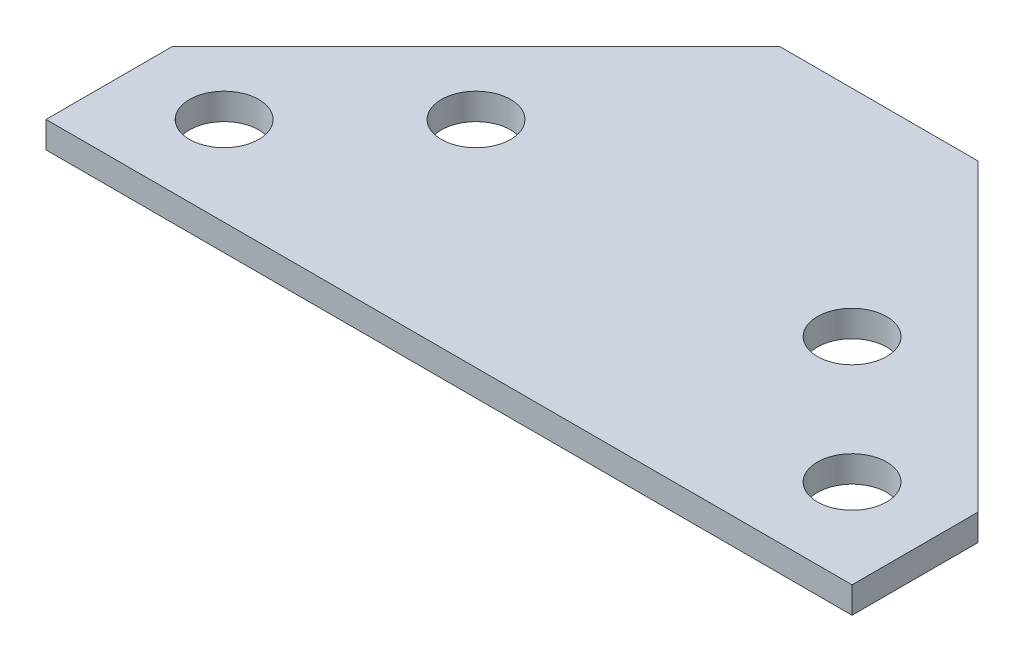
ISO-10303-21;
HEADER;
FILE_DESCRIPTION(('STEP AP214'),'2;1');
FILE_NAME('part.step','',(''),(''),'','','');
FILE_SCHEMA(('AUTOMOTIVE_DESIGN { 1 0 10303 214 1 1 1 1 }'));
ENDSEC;
DATA;
#1=APPLICATION_CONTEXT('core data for automotive mechanical design processes');
#2=APPLICATION_PROTOCOL_DEFINITION('international standard','automotive_design',2000,#1);
#3=PRODUCT_CONTEXT('',#1,'mechanical');
#4=PRODUCT('Part','Part','',(#3));
#5=PRODUCT_RELATED_PRODUCT_CATEGORY('part','',(#4));
#6=PRODUCT_DEFINITION_FORMATION('','',#4);
#7=PRODUCT_DEFINITION_CONTEXT('part definition',#1,'design');
#8=PRODUCT_DEFINITION('design','',#6,#7);
#9=PRODUCT_DEFINITION_SHAPE('','',#8);
#10=(LENGTH_UNIT() NAMED_UNIT(*) SI_UNIT(.MILLI.,.METRE.));
#11=(NAMED_UNIT(*) PLANE_ANGLE_UNIT() SI_UNIT($,.RADIAN.));
#12=(NAMED_UNIT(*) SI_UNIT($,.STERADIAN.) SOLID_ANGLE_UNIT());
#13=UNCERTAINTY_MEASURE_WITH_UNIT(LENGTH_MEASURE(1.E-05),#10,'distance_accuracy_value','');
#14=(GEOMETRIC_REPRESENTATION_CONTEXT(3) GLOBAL_UNCERTAINTY_ASSIGNED_CONTEXT((#13)) GLOBAL_UNIT_ASSIGNED_CONTEXT((#10,
#11,#12)) REPRESENTATION_CONTEXT('',''));
#15=CARTESIAN_POINT('',(0.,0.,0.));
#16=DIRECTION('',(0.,0.,1.));
#17=DIRECTION('',(1.,0.,0.));
#18=AXIS2_PLACEMENT_3D('',#15,#16,#17);
#19=CARTESIAN_POINT('',(-61.0918830920367,-4.,-19.0918830920368));
#20=DIRECTION('',(-1.,0.,0.));
#21=DIRECTION('',(0.,0.,1.));
#22=AXIS2_PLACEMENT_3D('',#19,#20,#21);
#23=PLANE('',#22);
#24=DIRECTION('',(0.,0.,1.));
#25=VECTOR('',#24,1.);
#26=CARTESIAN_POINT('',(-61.0918830920367,0.,-19.0918830920368));
#27=LINE('',#26,#25);
#28=CARTESIAN_POINT('',(-61.0918830920367,0.,-19.0918830920368));
#29=VERTEX_POINT('',#28);
#30=CARTESIAN_POINT('',(-61.0918830920367,0.,0.));
#31=VERTEX_POINT('',#30);
#32=EDGE_CURVE('E125',#29,#31,#27,.T.);
#33=ORIENTED_EDGE('',*,*,#32,.F.);
#34=DIRECTION('',(0.,1.,0.));
#35=VECTOR('',#34,1.);
#36=CARTESIAN_POINT('',(-61.0918830920367,-4.,-19.0918830920368));
#37=LINE('',#36,#35);
#38=CARTESIAN_POINT('',(-61.0918830920367,-4.,-19.0918830920368));
#39=VERTEX_POINT('',#38);
#40=EDGE_CURVE('E11',#39,#29,#37,.T.);
#41=ORIENTED_EDGE('',*,*,#40,.F.);
#42=DIRECTION('',(0.,0.,1.));
#43=VECTOR('',#42,1.);
#44=CARTESIAN_POINT('',(-61.0918830920367,-4.,-19.0918830920368));
#45=LINE('',#44,#43);
#46=CARTESIAN_POINT('',(-61.0918830920367,-4.,0.));
#47=VERTEX_POINT('',#46);
#48=EDGE_CURVE('E140',#39,#47,#45,.T.);
#49=ORIENTED_EDGE('',*,*,#48,.T.);
#50=DIRECTION('',(0.,1.,0.));
#51=VECTOR('',#50,1.);
#52=CARTESIAN_POINT('',(-61.0918830920367,-4.,0.));
#53=LINE('',#52,#51);
#54=EDGE_CURVE('E43',#47,#31,#53,.T.);
#55=ORIENTED_EDGE('',*,*,#54,.T.);
#56=EDGE_LOOP('',(#33,#41,#49,#55));
#57=FACE_BOUND('',#56,.T.);
#58=ADVANCED_FACE('F39',(#57),#23,.T.);
#59=CARTESIAN_POINT('',(-15.,-4.,-65.1837661840737));
#60=DIRECTION('',(-0.707106781186549,0.,-0.707106781186546));
#61=DIRECTION('',(-0.707106781186546,0.,0.707106781186549));
#62=AXIS2_PLACEMENT_3D('',#59,#60,#61);
#63=PLANE('',#62);
#64=DIRECTION('',(-0.707106781186546,0.,0.707106781186549));
#65=VECTOR('',#64,1.);
#66=CARTESIAN_POINT('',(-15.,0.,-65.1837661840737));
#67=LINE('',#66,#65);
#68=CARTESIAN_POINT('',(-15.,0.,-65.1837661840737));
#69=VERTEX_POINT('',#68);
#70=EDGE_CURVE('E138',#69,#29,#67,.T.);
#71=ORIENTED_EDGE('',*,*,#70,.F.);
#72=DIRECTION('',(0.,1.,0.));
#73=VECTOR('',#72,1.);
#74=CARTESIAN_POINT('',(-15.,-4.,-65.1837661840737));
#75=LINE('',#74,#73);
#76=CARTESIAN_POINT('',(-15.,-4.,-65.1837661840737));
#77=VERTEX_POINT('',#76);
#78=EDGE_CURVE('E49',#77,#69,#75,.T.);
#79=ORIENTED_EDGE('',*,*,#78,.F.);
#80=DIRECTION('',(-0.707106781186546,0.,0.707106781186549));
#81=VECTOR('',#80,1.);
#82=CARTESIAN_POINT('',(-15.,-4.,-65.1837661840737));
#83=LINE('',#82,#81);
#84=EDGE_CURVE('E115',#77,#39,#83,.T.);
#85=ORIENTED_EDGE('',*,*,#84,.T.);
#86=ORIENTED_EDGE('',*,*,#40,.T.);
#87=EDGE_LOOP('',(#71,#79,#85,#86));
#88=FACE_BOUND('',#87,.T.);
#89=ADVANCED_FACE('F147',(#88),#63,.T.);
#90=CARTESIAN_POINT('',(15.,-4.,-65.1837661840737));
#91=DIRECTION('',(0.,0.,-1.));
#92=DIRECTION('',(-1.,0.,0.));
#93=AXIS2_PLACEMENT_3D('',#90,#91,#92);
#94=PLANE('',#93);
#95=DIRECTION('',(-1.,0.,0.));
#96=VECTOR('',#95,1.);
#97=CARTESIAN_POINT('',(15.,0.,-65.1837661840737));
#98=LINE('',#97,#96);
#99=CARTESIAN_POINT('',(15.,0.,-65.1837661840737));
#100=VERTEX_POINT('',#99);
#101=EDGE_CURVE('E102',#100,#69,#98,.T.);
#102=ORIENTED_EDGE('',*,*,#101,.F.);
#103=DIRECTION('',(0.,1.,0.));
#104=VECTOR('',#103,1.);
#105=CARTESIAN_POINT('',(15.,-4.,-65.1837661840737));
#106=LINE('',#105,#104);
#107=CARTESIAN_POINT('',(15.,-4.,-65.1837661840737));
#108=VERTEX_POINT('',#107);
#109=EDGE_CURVE('E97',#108,#100,#106,.T.);
#110=ORIENTED_EDGE('',*,*,#109,.F.);
#111=DIRECTION('',(-1.,0.,0.));
#112=VECTOR('',#111,1.);
#113=CARTESIAN_POINT('',(15.,-4.,-65.1837661840737));
#114=LINE('',#113,#112);
#115=EDGE_CURVE('E100',#108,#77,#114,.T.);
#116=ORIENTED_EDGE('',*,*,#115,.T.);
#117=ORIENTED_EDGE('',*,*,#78,.T.);
#118=EDGE_LOOP('',(#102,#110,#116,#117));
#119=FACE_BOUND('',#118,.T.);
#120=ADVANCED_FACE('F99',(#119),#94,.T.);
#121=CARTESIAN_POINT('',(61.0918830920367,-4.,-19.0918830920368));
#122=DIRECTION('',(0.707106781186549,0.,-0.707106781186546));
#123=DIRECTION('',(-0.707106781186546,0.,-0.707106781186549));
#124=AXIS2_PLACEMENT_3D('',#121,#122,#123);
#125=PLANE('',#124);
#126=DIRECTION('',(-0.707106781186546,0.,-0.707106781186549));
#127=VECTOR('',#126,1.);
#128=CARTESIAN_POINT('',(61.0918830920367,0.,-19.0918830920368));
#129=LINE('',#128,#127);
#130=CARTESIAN_POINT('',(61.0918830920367,0.,-19.0918830920368));
#131=VERTEX_POINT('',#130);
#132=EDGE_CURVE('E135',#131,#100,#129,.T.);
#133=ORIENTED_EDGE('',*,*,#132,.F.);
#134=DIRECTION('',(0.,1.,0.));
#135=VECTOR('',#134,1.);
#136=CARTESIAN_POINT('',(61.0918830920367,-4.,-19.0918830920368));
#137=LINE('',#136,#135);
#138=CARTESIAN_POINT('',(61.0918830920367,-4.,-19.0918830920368));
#139=VERTEX_POINT('',#138);
#140=EDGE_CURVE('E107',#139,#131,#137,.T.);
#141=ORIENTED_EDGE('',*,*,#140,.F.);
#142=DIRECTION('',(-0.707106781186546,0.,-0.707106781186549));
#143=VECTOR('',#142,1.);
#144=CARTESIAN_POINT('',(61.0918830920367,-4.,-19.0918830920368));
#145=LINE('',#144,#143);
#146=EDGE_CURVE('E113',#139,#108,#145,.T.);
#147=ORIENTED_EDGE('',*,*,#146,.T.);
#148=ORIENTED_EDGE('',*,*,#109,.T.);
#149=EDGE_LOOP('',(#133,#141,#147,#148));
#150=FACE_BOUND('',#149,.T.);
#151=ADVANCED_FACE('F117',(#150),#125,.T.);
#152=CARTESIAN_POINT('',(61.0918830920367,-4.,0.));
#153=DIRECTION('',(1.,0.,0.));
#154=DIRECTION('',(0.,0.,-1.));
#155=AXIS2_PLACEMENT_3D('',#152,#153,#154);
#156=PLANE('',#155);
#157=DIRECTION('',(0.,0.,-1.));
#158=VECTOR('',#157,1.);
#159=CARTESIAN_POINT('',(61.0918830920367,0.,0.));
#160=LINE('',#159,#158);
#161=CARTESIAN_POINT('',(61.0918830920367,0.,0.));
#162=VERTEX_POINT('',#161);
#163=EDGE_CURVE('E132',#162,#131,#160,.T.);
#164=ORIENTED_EDGE('',*,*,#163,.F.);
#165=DIRECTION('',(0.,1.,0.));
#166=VECTOR('',#165,1.);
#167=CARTESIAN_POINT('',(61.0918830920367,-4.,0.));
#168=LINE('',#167,#166);
#169=CARTESIAN_POINT('',(61.0918830920367,-4.,0.));
#170=VERTEX_POINT('',#169);
#171=EDGE_CURVE('E143',#170,#162,#168,.T.);
#172=ORIENTED_EDGE('',*,*,#171,.F.);
#173=DIRECTION('',(0.,0.,-1.));
#174=VECTOR('',#173,1.);
#175=CARTESIAN_POINT('',(61.0918830920367,-4.,0.));
#176=LINE('',#175,#174);
#177=EDGE_CURVE('E118',#170,#139,#176,.T.);
#178=ORIENTED_EDGE('',*,*,#177,.T.);
#179=ORIENTED_EDGE('',*,*,#140,.T.);
#180=EDGE_LOOP('',(#164,#172,#178,#179));
#181=FACE_BOUND('',#180,.T.);
#182=ADVANCED_FACE('F160',(#181),#156,.T.);
#183=CARTESIAN_POINT('',(-61.0918830920367,-4.,0.));
#184=DIRECTION('',(0.,0.,1.));
#185=DIRECTION('',(1.,0.,0.));
#186=AXIS2_PLACEMENT_3D('',#183,#184,#185);
#187=PLANE('',#186);
#188=DIRECTION('',(1.,0.,0.));
#189=VECTOR('',#188,1.);
#190=CARTESIAN_POINT('',(-61.0918830920367,0.,0.));
#191=LINE('',#190,#189);
#192=EDGE_CURVE('E128',#31,#162,#191,.T.);
#193=ORIENTED_EDGE('',*,*,#192,.F.);
#194=ORIENTED_EDGE('',*,*,#54,.F.);
#195=DIRECTION('',(1.,0.,0.));
#196=VECTOR('',#195,1.);
#197=CARTESIAN_POINT('',(-61.0918830920367,-4.,0.));
#198=LINE('',#197,#196);
#199=EDGE_CURVE('E120',#47,#170,#198,.T.);
#200=ORIENTED_EDGE('',*,*,#199,.T.);
#201=ORIENTED_EDGE('',*,*,#171,.T.);
#202=EDGE_LOOP('',(#193,#194,#200,#201));
#203=FACE_BOUND('',#202,.T.);
#204=ADVANCED_FACE('F145',(#203),#187,.T.);
#205=CARTESIAN_POINT('',(0.,-4.,0.));
#206=DIRECTION('',(0.,1.,0.));
#207=DIRECTION('',(0.,0.,1.));
#208=AXIS2_PLACEMENT_3D('',#205,#206,#207);
#209=PLANE('',#208);
#210=CARTESIAN_POINT('',(28.5,-4.,-32.5918830920368));
#211=DIRECTION('',(0.,1.,0.));
#212=DIRECTION('',(0.,0.,-1.));
#213=AXIS2_PLACEMENT_3D('',#210,#211,#212);
#214=CIRCLE('',#213,5.25);
#215=CARTESIAN_POINT('',(28.5,-4.,-37.8418830920368));
#216=VERTEX_POINT('',#215);
#217=EDGE_CURVE('E177',#216,#216,#214,.T.);
#218=ORIENTED_EDGE('',*,*,#217,.T.);
#219=EDGE_LOOP('',(#218));
#220=FACE_BOUND('',#219,.T.);
#221=CARTESIAN_POINT('',(47.5918830920367,-4.,-13.5));
#222=DIRECTION('',(0.,1.,0.));
#223=DIRECTION('',(0.,0.,-1.));
#224=AXIS2_PLACEMENT_3D('',#221,#222,#223);
#225=CIRCLE('',#224,5.25);
#226=CARTESIAN_POINT('',(47.5918830920367,-4.,-18.75));
#227=VERTEX_POINT('',#226);
#228=EDGE_CURVE('E181',#227,#227,#225,.T.);
#229=ORIENTED_EDGE('',*,*,#228,.T.);
#230=EDGE_LOOP('',(#229));
#231=FACE_BOUND('',#230,.T.);
#232=CARTESIAN_POINT('',(-47.5918830920367,-4.,-13.5));
#233=DIRECTION('',(0.,1.,0.));
#234=DIRECTION('',(0.,0.,1.));
#235=AXIS2_PLACEMENT_3D('',#232,#233,#234);
#236=CIRCLE('',#235,5.25);
#237=CARTESIAN_POINT('',(-47.5918830920367,-4.,-8.25));
#238=VERTEX_POINT('',#237);
#239=EDGE_CURVE('E185',#238,#238,#236,.T.);
#240=ORIENTED_EDGE('',*,*,#239,.T.);
#241=EDGE_LOOP('',(#240));
#242=FACE_BOUND('',#241,.T.);
#243=CARTESIAN_POINT('',(-28.5,-4.,-32.5918830920368));
#244=DIRECTION('',(0.,1.,0.));
#245=DIRECTION('',(0.,0.,1.));
#246=AXIS2_PLACEMENT_3D('',#243,#244,#245);
#247=CIRCLE('',#246,5.25);
#248=CARTESIAN_POINT('',(-28.5,-4.,-27.3418830920368));
#249=VERTEX_POINT('',#248);
#250=EDGE_CURVE('E129',#249,#249,#247,.T.);
#251=ORIENTED_EDGE('',*,*,#250,.T.);
#252=EDGE_LOOP('',(#251));
#253=FACE_BOUND('',#252,.T.);
#254=ORIENTED_EDGE('',*,*,#48,.F.);
#255=ORIENTED_EDGE('',*,*,#84,.F.);
#256=ORIENTED_EDGE('',*,*,#115,.F.);
#257=ORIENTED_EDGE('',*,*,#146,.F.);
#258=ORIENTED_EDGE('',*,*,#177,.F.);
#259=ORIENTED_EDGE('',*,*,#199,.F.);
#260=EDGE_LOOP('',(#254,#255,#256,#257,#258,#259));
#261=FACE_BOUND('',#260,.T.);
#262=ADVANCED_FACE('F111',(#220,#231,#242,#253,#261),#209,.F.);
#263=CARTESIAN_POINT('',(0.,0.,0.));
#264=DIRECTION('',(0.,1.,0.));
#265=DIRECTION('',(0.,0.,1.));
#266=AXIS2_PLACEMENT_3D('',#263,#264,#265);
#267=PLANE('',#266);
#268=CARTESIAN_POINT('',(28.5,0.,-32.5918830920368));
#269=DIRECTION('',(0.,1.,0.));
#270=DIRECTION('',(0.,0.,-1.));
#271=AXIS2_PLACEMENT_3D('',#268,#269,#270);
#272=CIRCLE('',#271,5.25);
#273=CARTESIAN_POINT('',(28.5,0.,-37.8418830920368));
#274=VERTEX_POINT('',#273);
#275=EDGE_CURVE('E203',#274,#274,#272,.T.);
#276=ORIENTED_EDGE('',*,*,#275,.F.);
#277=EDGE_LOOP('',(#276));
#278=FACE_BOUND('',#277,.T.);
#279=CARTESIAN_POINT('',(47.5918830920367,0.,-13.5));
#280=DIRECTION('',(0.,1.,0.));
#281=DIRECTION('',(0.,0.,-1.));
#282=AXIS2_PLACEMENT_3D('',#279,#280,#281);
#283=CIRCLE('',#282,5.25);
#284=CARTESIAN_POINT('',(47.5918830920367,0.,-18.75));
#285=VERTEX_POINT('',#284);
#286=EDGE_CURVE('E199',#285,#285,#283,.T.);
#287=ORIENTED_EDGE('',*,*,#286,.F.);
#288=EDGE_LOOP('',(#287));
#289=FACE_BOUND('',#288,.T.);
#290=CARTESIAN_POINT('',(-47.5918830920367,0.,-13.5));
#291=DIRECTION('',(0.,1.,0.));
#292=DIRECTION('',(0.,0.,1.));
#293=AXIS2_PLACEMENT_3D('',#290,#291,#292);
#294=CIRCLE('',#293,5.25);
#295=CARTESIAN_POINT('',(-47.5918830920367,0.,-8.25));
#296=VERTEX_POINT('',#295);
#297=EDGE_CURVE('E194',#296,#296,#294,.T.);
#298=ORIENTED_EDGE('',*,*,#297,.F.);
#299=EDGE_LOOP('',(#298));
#300=FACE_BOUND('',#299,.T.);
#301=CARTESIAN_POINT('',(-28.5,0.,-32.5918830920368));
#302=DIRECTION('',(0.,1.,0.));
#303=DIRECTION('',(0.,0.,1.));
#304=AXIS2_PLACEMENT_3D('',#301,#302,#303);
#305=CIRCLE('',#304,5.25);
#306=CARTESIAN_POINT('',(-28.5,0.,-27.3418830920368));
#307=VERTEX_POINT('',#306);
#308=EDGE_CURVE('E189',#307,#307,#305,.T.);
#309=ORIENTED_EDGE('',*,*,#308,.F.);
#310=EDGE_LOOP('',(#309));
#311=FACE_BOUND('',#310,.T.);
#312=ORIENTED_EDGE('',*,*,#32,.T.);
#313=ORIENTED_EDGE('',*,*,#192,.T.);
#314=ORIENTED_EDGE('',*,*,#163,.T.);
#315=ORIENTED_EDGE('',*,*,#132,.T.);
#316=ORIENTED_EDGE('',*,*,#101,.T.);
#317=ORIENTED_EDGE('',*,*,#70,.T.);
#318=EDGE_LOOP('',(#312,#313,#314,#315,#316,#317));
#319=FACE_BOUND('',#318,.T.);
#320=ADVANCED_FACE('F41',(#278,#289,#300,#311,#319),#267,.T.);
#321=CARTESIAN_POINT('',(-28.5,-4.,-32.5918830920368));
#322=DIRECTION('',(0.,1.,0.));
#323=DIRECTION('',(0.,0.,1.));
#324=AXIS2_PLACEMENT_3D('',#321,#322,#323);
#325=CYLINDRICAL_SURFACE('',#324,5.25);
#326=ORIENTED_EDGE('',*,*,#250,.F.);
#327=EDGE_LOOP('',(#326));
#328=FACE_BOUND('',#327,.T.);
#329=ORIENTED_EDGE('',*,*,#308,.T.);
#330=EDGE_LOOP('',(#329));
#331=FACE_BOUND('',#330,.T.);
#332=ADVANCED_FACE('F172',(#328,#331),#325,.F.);
#333=CARTESIAN_POINT('',(-47.5918830920367,-4.,-13.5));
#334=DIRECTION('',(0.,1.,0.));
#335=DIRECTION('',(0.,0.,1.));
#336=AXIS2_PLACEMENT_3D('',#333,#334,#335);
#337=CYLINDRICAL_SURFACE('',#336,5.25);
#338=ORIENTED_EDGE('',*,*,#239,.F.);
#339=EDGE_LOOP('',(#338));
#340=FACE_BOUND('',#339,.T.);
#341=ORIENTED_EDGE('',*,*,#297,.T.);
#342=EDGE_LOOP('',(#341));
#343=FACE_BOUND('',#342,.T.);
#344=ADVANCED_FACE('F217',(#340,#343),#337,.F.);
#345=CARTESIAN_POINT('',(47.5918830920367,-4.,-13.5));
#346=DIRECTION('',(0.,1.,0.));
#347=DIRECTION('',(0.,0.,1.));
#348=AXIS2_PLACEMENT_3D('',#345,#346,#347);
#349=CYLINDRICAL_SURFACE('',#348,5.25);
#350=ORIENTED_EDGE('',*,*,#228,.F.);
#351=EDGE_LOOP('',(#350));
#352=FACE_BOUND('',#351,.T.);
#353=ORIENTED_EDGE('',*,*,#286,.T.);
#354=EDGE_LOOP('',(#353));
#355=FACE_BOUND('',#354,.T.);
#356=ADVANCED_FACE('F221',(#352,#355),#349,.F.);
#357=CARTESIAN_POINT('',(28.5,-4.,-32.5918830920368));
#358=DIRECTION('',(0.,1.,0.));
#359=DIRECTION('',(0.,0.,1.));
#360=AXIS2_PLACEMENT_3D('',#357,#358,#359);
#361=CYLINDRICAL_SURFACE('',#360,5.25);
#362=ORIENTED_EDGE('',*,*,#217,.F.);
#363=EDGE_LOOP('',(#362));
#364=FACE_BOUND('',#363,.T.);
#365=ORIENTED_EDGE('',*,*,#275,.T.);
#366=EDGE_LOOP('',(#365));
#367=FACE_BOUND('',#366,.T.);
#368=ADVANCED_FACE('F208',(#364,#367),#361,.F.);
#369=CLOSED_SHELL('',(#58,#89,#120,#151,#182,#204,#262,#320,#332,#344,#356,#368));
#370=MANIFOLD_SOLID_BREP('B2',#369);
#371=ADVANCED_BREP_SHAPE_REPRESENTATION('',(#18,#370),#14);
#372=SHAPE_DEFINITION_REPRESENTATION(#9,#371);
ENDSEC;
END-ISO-10303-21;
